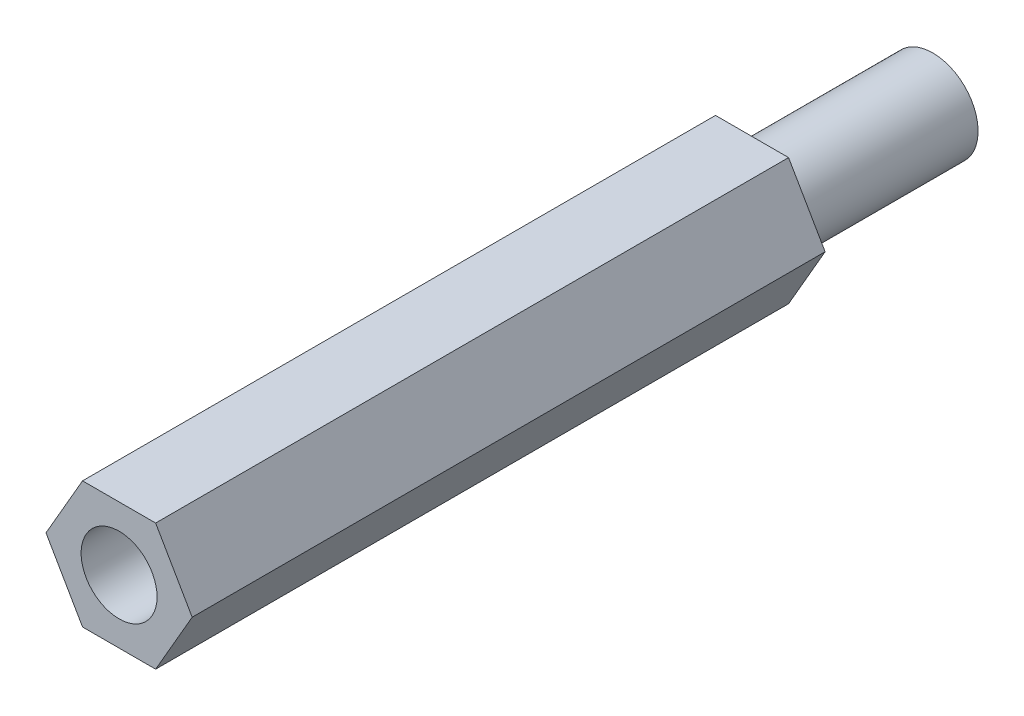
ISO-10303-21;
HEADER;
FILE_DESCRIPTION(('STEP AP214'),'2;1');
FILE_NAME('part.step','',(''),(''),'','','');
FILE_SCHEMA(('AUTOMOTIVE_DESIGN { 1 0 10303 214 1 1 1 1 }'));
ENDSEC;
DATA;
#1=APPLICATION_CONTEXT('core data for automotive mechanical design processes');
#2=APPLICATION_PROTOCOL_DEFINITION('international standard','automotive_design',2000,#1);
#3=PRODUCT_CONTEXT('',#1,'mechanical');
#4=PRODUCT('Part','Part','',(#3));
#5=PRODUCT_RELATED_PRODUCT_CATEGORY('part','',(#4));
#6=PRODUCT_DEFINITION_FORMATION('','',#4);
#7=PRODUCT_DEFINITION_CONTEXT('part definition',#1,'design');
#8=PRODUCT_DEFINITION('design','',#6,#7);
#9=PRODUCT_DEFINITION_SHAPE('','',#8);
#10=(LENGTH_UNIT() NAMED_UNIT(*) SI_UNIT(.MILLI.,.METRE.));
#11=(NAMED_UNIT(*) PLANE_ANGLE_UNIT() SI_UNIT($,.RADIAN.));
#12=(NAMED_UNIT(*) SI_UNIT($,.STERADIAN.) SOLID_ANGLE_UNIT());
#13=UNCERTAINTY_MEASURE_WITH_UNIT(LENGTH_MEASURE(1.E-05),#10,'distance_accuracy_value','');
#14=(GEOMETRIC_REPRESENTATION_CONTEXT(3) GLOBAL_UNCERTAINTY_ASSIGNED_CONTEXT((#13)) GLOBAL_UNIT_ASSIGNED_CONTEXT((#10,
#11,#12)) REPRESENTATION_CONTEXT('',''));
#15=CARTESIAN_POINT('',(0.,0.,0.));
#16=DIRECTION('',(0.,0.,1.));
#17=DIRECTION('',(1.,0.,0.));
#18=AXIS2_PLACEMENT_3D('',#15,#16,#17);
#19=CARTESIAN_POINT('',(2.02072594216369,3.5,35.));
#20=DIRECTION('',(0.,-1.,0.));
#21=DIRECTION('',(1.,0.,0.));
#22=AXIS2_PLACEMENT_3D('',#19,#20,#21);
#23=PLANE('',#22);
#24=DIRECTION('',(-1.,0.,0.));
#25=VECTOR('',#24,1.);
#26=CARTESIAN_POINT('',(2.02072594216369,3.5,0.));
#27=LINE('',#26,#25);
#28=CARTESIAN_POINT('',(2.02072594216369,3.5,0.));
#29=VERTEX_POINT('',#28);
#30=CARTESIAN_POINT('',(-2.02072594216369,3.5,0.));
#31=VERTEX_POINT('',#30);
#32=EDGE_CURVE('E124',#29,#31,#27,.T.);
#33=ORIENTED_EDGE('',*,*,#32,.T.);
#34=DIRECTION('',(0.,0.,-1.));
#35=VECTOR('',#34,1.);
#36=CARTESIAN_POINT('',(-2.02072594216369,3.5,35.));
#37=LINE('',#36,#35);
#38=CARTESIAN_POINT('',(-2.02072594216369,3.5,35.));
#39=VERTEX_POINT('',#38);
#40=EDGE_CURVE('E39',#39,#31,#37,.T.);
#41=ORIENTED_EDGE('',*,*,#40,.F.);
#42=DIRECTION('',(-1.,0.,0.));
#43=VECTOR('',#42,1.);
#44=CARTESIAN_POINT('',(2.02072594216369,3.5,35.));
#45=LINE('',#44,#43);
#46=CARTESIAN_POINT('',(2.02072594216369,3.5,35.));
#47=VERTEX_POINT('',#46);
#48=EDGE_CURVE('E135',#47,#39,#45,.T.);
#49=ORIENTED_EDGE('',*,*,#48,.F.);
#50=DIRECTION('',(0.,0.,-1.));
#51=VECTOR('',#50,1.);
#52=CARTESIAN_POINT('',(2.02072594216369,3.5,35.));
#53=LINE('',#52,#51);
#54=EDGE_CURVE('E120',#47,#29,#53,.T.);
#55=ORIENTED_EDGE('',*,*,#54,.T.);
#56=EDGE_LOOP('',(#33,#41,#49,#55));
#57=FACE_BOUND('',#56,.T.);
#58=ADVANCED_FACE('F36',(#57),#23,.F.);
#59=CARTESIAN_POINT('',(-2.02072594216369,3.5,35.));
#60=DIRECTION('',(0.866025403784439,-0.5,0.));
#61=DIRECTION('',(0.5,0.866025403784439,0.));
#62=AXIS2_PLACEMENT_3D('',#59,#60,#61);
#63=PLANE('',#62);
#64=DIRECTION('',(-0.5,-0.866025403784439,0.));
#65=VECTOR('',#64,1.);
#66=CARTESIAN_POINT('',(-2.02072594216369,3.5,0.));
#67=LINE('',#66,#65);
#68=CARTESIAN_POINT('',(-4.04145188432738,0.,0.));
#69=VERTEX_POINT('',#68);
#70=EDGE_CURVE('E127',#31,#69,#67,.T.);
#71=ORIENTED_EDGE('',*,*,#70,.T.);
#72=DIRECTION('',(0.,0.,-1.));
#73=VECTOR('',#72,1.);
#74=CARTESIAN_POINT('',(-4.04145188432738,0.,35.));
#75=LINE('',#74,#73);
#76=CARTESIAN_POINT('',(-4.04145188432738,0.,35.));
#77=VERTEX_POINT('',#76);
#78=EDGE_CURVE('E138',#77,#69,#75,.T.);
#79=ORIENTED_EDGE('',*,*,#78,.F.);
#80=DIRECTION('',(-0.5,-0.866025403784439,0.));
#81=VECTOR('',#80,1.);
#82=CARTESIAN_POINT('',(-2.02072594216369,3.5,35.));
#83=LINE('',#82,#81);
#84=EDGE_CURVE('E92',#39,#77,#83,.T.);
#85=ORIENTED_EDGE('',*,*,#84,.F.);
#86=ORIENTED_EDGE('',*,*,#40,.T.);
#87=EDGE_LOOP('',(#71,#79,#85,#86));
#88=FACE_BOUND('',#87,.T.);
#89=ADVANCED_FACE('F143',(#88),#63,.F.);
#90=CARTESIAN_POINT('',(-4.04145188432738,0.,35.));
#91=DIRECTION('',(0.866025403784439,0.5,0.));
#92=DIRECTION('',(-0.5,0.866025403784438,0.));
#93=AXIS2_PLACEMENT_3D('',#90,#91,#92);
#94=PLANE('',#93);
#95=DIRECTION('',(0.5,-0.866025403784439,0.));
#96=VECTOR('',#95,1.);
#97=CARTESIAN_POINT('',(-4.04145188432738,0.,0.));
#98=LINE('',#97,#96);
#99=CARTESIAN_POINT('',(-2.02072594216369,-3.5,0.));
#100=VERTEX_POINT('',#99);
#101=EDGE_CURVE('E130',#69,#100,#98,.T.);
#102=ORIENTED_EDGE('',*,*,#101,.T.);
#103=DIRECTION('',(0.,0.,-1.));
#104=VECTOR('',#103,1.);
#105=CARTESIAN_POINT('',(-2.02072594216369,-3.5,35.));
#106=LINE('',#105,#104);
#107=CARTESIAN_POINT('',(-2.02072594216369,-3.5,35.));
#108=VERTEX_POINT('',#107);
#109=EDGE_CURVE('E115',#108,#100,#106,.T.);
#110=ORIENTED_EDGE('',*,*,#109,.F.);
#111=DIRECTION('',(0.5,-0.866025403784439,0.));
#112=VECTOR('',#111,1.);
#113=CARTESIAN_POINT('',(-4.04145188432738,0.,35.));
#114=LINE('',#113,#112);
#115=EDGE_CURVE('E106',#77,#108,#114,.T.);
#116=ORIENTED_EDGE('',*,*,#115,.F.);
#117=ORIENTED_EDGE('',*,*,#78,.T.);
#118=EDGE_LOOP('',(#102,#110,#116,#117));
#119=FACE_BOUND('',#118,.T.);
#120=ADVANCED_FACE('F149',(#119),#94,.F.);
#121=CARTESIAN_POINT('',(-2.02072594216369,-3.5,35.));
#122=DIRECTION('',(0.,1.,0.));
#123=DIRECTION('',(-1.,0.,0.));
#124=AXIS2_PLACEMENT_3D('',#121,#122,#123);
#125=PLANE('',#124);
#126=DIRECTION('',(1.,0.,0.));
#127=VECTOR('',#126,1.);
#128=CARTESIAN_POINT('',(-2.02072594216369,-3.5,0.));
#129=LINE('',#128,#127);
#130=CARTESIAN_POINT('',(2.02072594216369,-3.5,0.));
#131=VERTEX_POINT('',#130);
#132=EDGE_CURVE('E114',#100,#131,#129,.T.);
#133=ORIENTED_EDGE('',*,*,#132,.T.);
#134=DIRECTION('',(0.,0.,-1.));
#135=VECTOR('',#134,1.);
#136=CARTESIAN_POINT('',(2.02072594216369,-3.5,35.));
#137=LINE('',#136,#135);
#138=CARTESIAN_POINT('',(2.02072594216369,-3.5,35.));
#139=VERTEX_POINT('',#138);
#140=EDGE_CURVE('E111',#139,#131,#137,.T.);
#141=ORIENTED_EDGE('',*,*,#140,.F.);
#142=DIRECTION('',(1.,0.,0.));
#143=VECTOR('',#142,1.);
#144=CARTESIAN_POINT('',(-2.02072594216369,-3.5,35.));
#145=LINE('',#144,#143);
#146=EDGE_CURVE('E100',#108,#139,#145,.T.);
#147=ORIENTED_EDGE('',*,*,#146,.F.);
#148=ORIENTED_EDGE('',*,*,#109,.T.);
#149=EDGE_LOOP('',(#133,#141,#147,#148));
#150=FACE_BOUND('',#149,.T.);
#151=ADVANCED_FACE('F112',(#150),#125,.F.);
#152=CARTESIAN_POINT('',(2.02072594216369,-3.5,35.));
#153=DIRECTION('',(-0.866025403784439,0.5,0.));
#154=DIRECTION('',(-0.5,-0.866025403784439,0.));
#155=AXIS2_PLACEMENT_3D('',#152,#153,#154);
#156=PLANE('',#155);
#157=DIRECTION('',(0.5,0.866025403784439,0.));
#158=VECTOR('',#157,1.);
#159=CARTESIAN_POINT('',(2.02072594216369,-3.5,0.));
#160=LINE('',#159,#158);
#161=CARTESIAN_POINT('',(4.04145188432738,0.,0.));
#162=VERTEX_POINT('',#161);
#163=EDGE_CURVE('E77',#131,#162,#160,.T.);
#164=ORIENTED_EDGE('',*,*,#163,.T.);
#165=DIRECTION('',(0.,0.,-1.));
#166=VECTOR('',#165,1.);
#167=CARTESIAN_POINT('',(4.04145188432738,0.,35.));
#168=LINE('',#167,#166);
#169=CARTESIAN_POINT('',(4.04145188432738,0.,35.));
#170=VERTEX_POINT('',#169);
#171=EDGE_CURVE('E116',#170,#162,#168,.T.);
#172=ORIENTED_EDGE('',*,*,#171,.F.);
#173=DIRECTION('',(0.5,0.866025403784439,0.));
#174=VECTOR('',#173,1.);
#175=CARTESIAN_POINT('',(2.02072594216369,-3.5,35.));
#176=LINE('',#175,#174);
#177=EDGE_CURVE('E104',#139,#170,#176,.T.);
#178=ORIENTED_EDGE('',*,*,#177,.F.);
#179=ORIENTED_EDGE('',*,*,#140,.T.);
#180=EDGE_LOOP('',(#164,#172,#178,#179));
#181=FACE_BOUND('',#180,.T.);
#182=ADVANCED_FACE('F118',(#181),#156,.F.);
#183=CARTESIAN_POINT('',(4.04145188432738,0.,35.));
#184=DIRECTION('',(-0.866025403784439,-0.5,0.));
#185=DIRECTION('',(0.5,-0.866025403784439,0.));
#186=AXIS2_PLACEMENT_3D('',#183,#184,#185);
#187=PLANE('',#186);
#188=DIRECTION('',(-0.5,0.866025403784438,0.));
#189=VECTOR('',#188,1.);
#190=CARTESIAN_POINT('',(4.04145188432738,0.,0.));
#191=LINE('',#190,#189);
#192=EDGE_CURVE('E83',#162,#29,#191,.T.);
#193=ORIENTED_EDGE('',*,*,#192,.T.);
#194=ORIENTED_EDGE('',*,*,#54,.F.);
#195=DIRECTION('',(-0.5,0.866025403784438,0.));
#196=VECTOR('',#195,1.);
#197=CARTESIAN_POINT('',(4.04145188432738,0.,35.));
#198=LINE('',#197,#196);
#199=EDGE_CURVE('E53',#170,#47,#198,.T.);
#200=ORIENTED_EDGE('',*,*,#199,.F.);
#201=ORIENTED_EDGE('',*,*,#171,.T.);
#202=EDGE_LOOP('',(#193,#194,#200,#201));
#203=FACE_BOUND('',#202,.T.);
#204=ADVANCED_FACE('F165',(#203),#187,.F.);
#205=CARTESIAN_POINT('',(0.,0.,35.));
#206=DIRECTION('',(0.,0.,1.));
#207=DIRECTION('',(1.,0.,0.));
#208=AXIS2_PLACEMENT_3D('',#205,#206,#207);
#209=PLANE('',#208);
#210=CARTESIAN_POINT('',(0.,0.,35.));
#211=DIRECTION('',(0.,0.,1.));
#212=DIRECTION('',(1.,0.,0.));
#213=AXIS2_PLACEMENT_3D('',#210,#211,#212);
#214=CIRCLE('',#213,2.1);
#215=CARTESIAN_POINT('',(2.1,0.,35.));
#216=VERTEX_POINT('',#215);
#217=EDGE_CURVE('E158',#216,#216,#214,.T.);
#218=ORIENTED_EDGE('',*,*,#217,.F.);
#219=EDGE_LOOP('',(#218));
#220=FACE_BOUND('',#219,.T.);
#221=ORIENTED_EDGE('',*,*,#48,.T.);
#222=ORIENTED_EDGE('',*,*,#84,.T.);
#223=ORIENTED_EDGE('',*,*,#115,.T.);
#224=ORIENTED_EDGE('',*,*,#146,.T.);
#225=ORIENTED_EDGE('',*,*,#177,.T.);
#226=ORIENTED_EDGE('',*,*,#199,.T.);
#227=EDGE_LOOP('',(#221,#222,#223,#224,#225,#226));
#228=FACE_BOUND('',#227,.T.);
#229=ADVANCED_FACE('F102',(#220,#228),#209,.T.);
#230=CARTESIAN_POINT('',(0.,0.,0.));
#231=DIRECTION('',(0.,0.,1.));
#232=DIRECTION('',(1.,0.,0.));
#233=AXIS2_PLACEMENT_3D('',#230,#231,#232);
#234=PLANE('',#233);
#235=CARTESIAN_POINT('',(0.,0.,0.));
#236=DIRECTION('',(0.,0.,-1.));
#237=DIRECTION('',(-1.,0.,0.));
#238=AXIS2_PLACEMENT_3D('',#235,#236,#237);
#239=CIRCLE('',#238,2.5);
#240=CARTESIAN_POINT('',(-2.5,0.,0.));
#241=VERTEX_POINT('',#240);
#242=EDGE_CURVE('E11',#241,#241,#239,.T.);
#243=ORIENTED_EDGE('',*,*,#242,.F.);
#244=EDGE_LOOP('',(#243));
#245=FACE_BOUND('',#244,.T.);
#246=ORIENTED_EDGE('',*,*,#32,.F.);
#247=ORIENTED_EDGE('',*,*,#192,.F.);
#248=ORIENTED_EDGE('',*,*,#163,.F.);
#249=ORIENTED_EDGE('',*,*,#132,.F.);
#250=ORIENTED_EDGE('',*,*,#101,.F.);
#251=ORIENTED_EDGE('',*,*,#70,.F.);
#252=EDGE_LOOP('',(#246,#247,#248,#249,#250,#251));
#253=FACE_BOUND('',#252,.T.);
#254=ADVANCED_FACE('F148',(#245,#253),#234,.F.);
#255=CARTESIAN_POINT('',(0.,0.,-10.));
#256=DIRECTION('',(0.,0.,1.));
#257=DIRECTION('',(1.,0.,0.));
#258=AXIS2_PLACEMENT_3D('',#255,#256,#257);
#259=CYLINDRICAL_SURFACE('',#258,2.5);
#260=CARTESIAN_POINT('',(0.,0.,-10.));
#261=DIRECTION('',(0.,0.,-1.));
#262=DIRECTION('',(-1.,0.,0.));
#263=AXIS2_PLACEMENT_3D('',#260,#261,#262);
#264=CIRCLE('',#263,2.5);
#265=CARTESIAN_POINT('',(-2.5,0.,-10.));
#266=VERTEX_POINT('',#265);
#267=EDGE_CURVE('E128',#266,#266,#264,.T.);
#268=ORIENTED_EDGE('',*,*,#267,.F.);
#269=EDGE_LOOP('',(#268));
#270=FACE_BOUND('',#269,.T.);
#271=ORIENTED_EDGE('',*,*,#242,.T.);
#272=EDGE_LOOP('',(#271));
#273=FACE_BOUND('',#272,.T.);
#274=ADVANCED_FACE('F171',(#270,#273),#259,.T.);
#275=CARTESIAN_POINT('',(0.,0.,-10.));
#276=DIRECTION('',(0.,0.,-1.));
#277=DIRECTION('',(-1.,0.,0.));
#278=AXIS2_PLACEMENT_3D('',#275,#276,#277);
#279=PLANE('',#278);
#280=ORIENTED_EDGE('',*,*,#267,.T.);
#281=EDGE_LOOP('',(#280));
#282=FACE_BOUND('',#281,.T.);
#283=ADVANCED_FACE('F212',(#282),#279,.T.);
#284=CARTESIAN_POINT('',(0.,0.,21.));
#285=DIRECTION('',(0.,0.,1.));
#286=DIRECTION('',(1.,0.,0.));
#287=AXIS2_PLACEMENT_3D('',#284,#285,#286);
#288=CONICAL_SURFACE('',#287,2.1,1.02974425867665);
#289=CARTESIAN_POINT('',(0.,0.,19.7381927000421));
#290=VERTEX_POINT('',#289);
#291=VERTEX_LOOP('',#290);
#292=FACE_BOUND('',#291,.T.);
#293=CARTESIAN_POINT('',(0.,0.,21.));
#294=DIRECTION('',(0.,0.,1.));
#295=DIRECTION('',(1.,0.,0.));
#296=AXIS2_PLACEMENT_3D('',#293,#294,#295);
#297=CIRCLE('',#296,2.1);
#298=CARTESIAN_POINT('',(2.1,0.,21.));
#299=VERTEX_POINT('',#298);
#300=EDGE_CURVE('E155',#299,#299,#297,.T.);
#301=ORIENTED_EDGE('',*,*,#300,.T.);
#302=EDGE_LOOP('',(#301));
#303=FACE_BOUND('',#302,.T.);
#304=ADVANCED_FACE('F220',(#292,#303),#288,.F.);
#305=CARTESIAN_POINT('',(0.,0.,35.));
#306=DIRECTION('',(0.,0.,1.));
#307=DIRECTION('',(1.,0.,0.));
#308=AXIS2_PLACEMENT_3D('',#305,#306,#307);
#309=CYLINDRICAL_SURFACE('',#308,2.1);
#310=ORIENTED_EDGE('',*,*,#300,.F.);
#311=EDGE_LOOP('',(#310));
#312=FACE_BOUND('',#311,.T.);
#313=ORIENTED_EDGE('',*,*,#217,.T.);
#314=EDGE_LOOP('',(#313));
#315=FACE_BOUND('',#314,.T.);
#316=ADVANCED_FACE('F162',(#312,#315),#309,.F.);
#317=CLOSED_SHELL('',(#58,#89,#120,#151,#182,#204,#229,#254,#274,#283,#304,#316));
#318=MANIFOLD_SOLID_BREP('B2',#317);
#319=ADVANCED_BREP_SHAPE_REPRESENTATION('',(#18,#318),#14);
#320=SHAPE_DEFINITION_REPRESENTATION(#9,#319);
ENDSEC;
END-ISO-10303-21;
